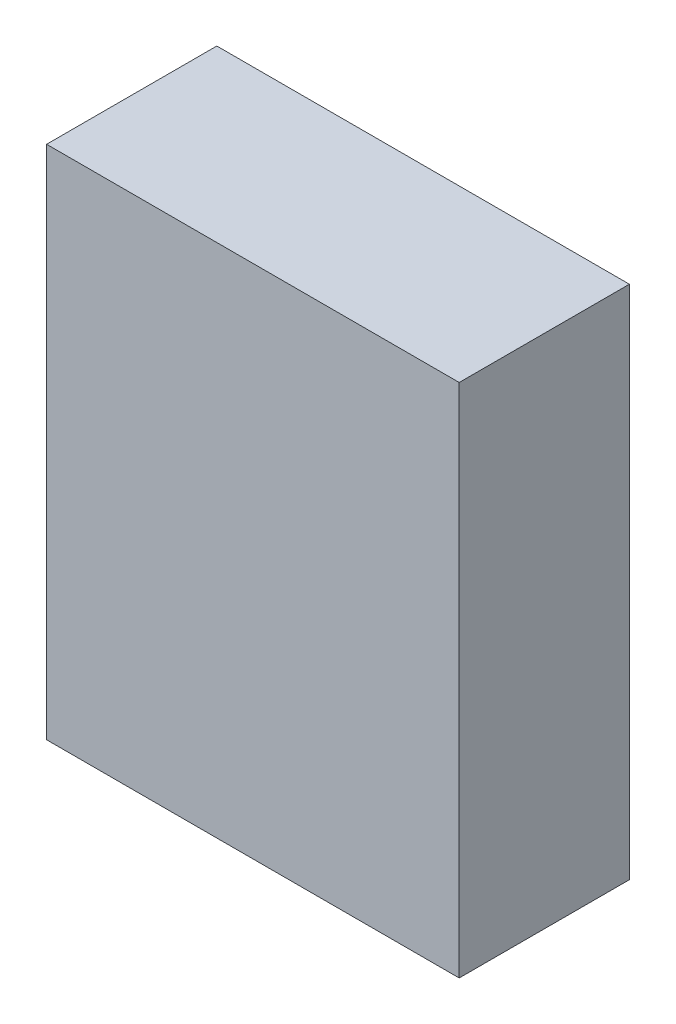
ISO-10303-21;
HEADER;
FILE_DESCRIPTION(('STEP AP214'),'2;1');
FILE_NAME('part.step','',(''),(''),'','','');
FILE_SCHEMA(('AUTOMOTIVE_DESIGN { 1 0 10303 214 1 1 1 1 }'));
ENDSEC;
DATA;
#1=APPLICATION_CONTEXT('core data for automotive mechanical design processes');
#2=APPLICATION_PROTOCOL_DEFINITION('international standard','automotive_design',2000,#1);
#3=PRODUCT_CONTEXT('',#1,'mechanical');
#4=PRODUCT('Part','Part','',(#3));
#5=PRODUCT_RELATED_PRODUCT_CATEGORY('part','',(#4));
#6=PRODUCT_DEFINITION_FORMATION('','',#4);
#7=PRODUCT_DEFINITION_CONTEXT('part definition',#1,'design');
#8=PRODUCT_DEFINITION('design','',#6,#7);
#9=PRODUCT_DEFINITION_SHAPE('','',#8);
#10=(LENGTH_UNIT() NAMED_UNIT(*) SI_UNIT(.MILLI.,.METRE.));
#11=(NAMED_UNIT(*) PLANE_ANGLE_UNIT() SI_UNIT($,.RADIAN.));
#12=(NAMED_UNIT(*) SI_UNIT($,.STERADIAN.) SOLID_ANGLE_UNIT());
#13=UNCERTAINTY_MEASURE_WITH_UNIT(LENGTH_MEASURE(1.E-05),#10,'distance_accuracy_value','');
#14=(GEOMETRIC_REPRESENTATION_CONTEXT(3) GLOBAL_UNCERTAINTY_ASSIGNED_CONTEXT((#13)) GLOBAL_UNIT_ASSIGNED_CONTEXT((#10,
#11,#12)) REPRESENTATION_CONTEXT('',''));
#15=CARTESIAN_POINT('',(0.,0.,0.));
#16=DIRECTION('',(0.,0.,1.));
#17=DIRECTION('',(1.,0.,0.));
#18=AXIS2_PLACEMENT_3D('',#15,#16,#17);
#19=CARTESIAN_POINT('',(-2.00000108,2.50000008,1.64999924));
#20=DIRECTION('',(0.,0.,-1.));
#21=DIRECTION('',(-1.,0.,0.));
#22=AXIS2_PLACEMENT_3D('',#19,#20,#21);
#23=PLANE('',#22);
#24=DIRECTION('',(1.,0.,0.));
#25=VECTOR('',#24,1.);
#26=CARTESIAN_POINT('',(-2.00000108,-2.50000008,1.64999924));
#27=LINE('',#26,#25);
#28=CARTESIAN_POINT('',(-2.00000108,-2.50000008,1.64999924));
#29=VERTEX_POINT('',#28);
#30=CARTESIAN_POINT('',(1.99999854,-2.50000008,1.64999924));
#31=VERTEX_POINT('',#30);
#32=EDGE_CURVE('E55',#29,#31,#27,.T.);
#33=ORIENTED_EDGE('',*,*,#32,.T.);
#34=DIRECTION('',(0.,1.,0.));
#35=VECTOR('',#34,1.);
#36=CARTESIAN_POINT('',(1.99999854,-2.50000008,1.64999924));
#37=LINE('',#36,#35);
#38=CARTESIAN_POINT('',(1.99999854,2.50000008,1.64999924));
#39=VERTEX_POINT('',#38);
#40=EDGE_CURVE('E57',#31,#39,#37,.T.);
#41=ORIENTED_EDGE('',*,*,#40,.T.);
#42=DIRECTION('',(1.,0.,0.));
#43=VECTOR('',#42,1.);
#44=CARTESIAN_POINT('',(1.99999854,2.50000008,1.64999924));
#45=LINE('',#44,#43);
#46=CARTESIAN_POINT('',(-2.00000108,2.50000008,1.64999924));
#47=VERTEX_POINT('',#46);
#48=EDGE_CURVE('E20',#39,#47,#45,.F.);
#49=ORIENTED_EDGE('',*,*,#48,.T.);
#50=DIRECTION('',(0.,1.,0.));
#51=VECTOR('',#50,1.);
#52=CARTESIAN_POINT('',(-2.00000108,2.50000008,1.64999924));
#53=LINE('',#52,#51);
#54=EDGE_CURVE('E80',#47,#29,#53,.F.);
#55=ORIENTED_EDGE('',*,*,#54,.T.);
#56=EDGE_LOOP('',(#33,#41,#49,#55));
#57=FACE_BOUND('',#56,.T.);
#58=ADVANCED_FACE('F17',(#57),#23,.F.);
#59=CARTESIAN_POINT('',(1.99999854,2.50000008,0.));
#60=DIRECTION('',(0.,-1.,0.));
#61=DIRECTION('',(0.,0.,-1.));
#62=AXIS2_PLACEMENT_3D('',#59,#60,#61);
#63=PLANE('',#62);
#64=DIRECTION('',(0.,0.,-1.));
#65=VECTOR('',#64,1.);
#66=CARTESIAN_POINT('',(-2.00000108,2.50000008,0.));
#67=LINE('',#66,#65);
#68=CARTESIAN_POINT('',(-2.00000108,2.50000008,0.));
#69=VERTEX_POINT('',#68);
#70=EDGE_CURVE('E68',#69,#47,#67,.F.);
#71=ORIENTED_EDGE('',*,*,#70,.T.);
#72=ORIENTED_EDGE('',*,*,#48,.F.);
#73=DIRECTION('',(0.,0.,1.));
#74=VECTOR('',#73,1.);
#75=CARTESIAN_POINT('',(1.99999854,2.50000008,0.));
#76=LINE('',#75,#74);
#77=CARTESIAN_POINT('',(1.99999854,2.50000008,0.));
#78=VERTEX_POINT('',#77);
#79=EDGE_CURVE('E63',#39,#78,#76,.F.);
#80=ORIENTED_EDGE('',*,*,#79,.T.);
#81=DIRECTION('',(-1.,0.,0.));
#82=VECTOR('',#81,1.);
#83=CARTESIAN_POINT('',(-2.00000108,2.50000008,0.));
#84=LINE('',#83,#82);
#85=EDGE_CURVE('E83',#69,#78,#84,.F.);
#86=ORIENTED_EDGE('',*,*,#85,.F.);
#87=EDGE_LOOP('',(#71,#72,#80,#86));
#88=FACE_BOUND('',#87,.T.);
#89=ADVANCED_FACE('F65',(#88),#63,.F.);
#90=CARTESIAN_POINT('',(1.99999854,-2.50000008,0.));
#91=DIRECTION('',(-1.,0.,0.));
#92=DIRECTION('',(0.,0.,1.));
#93=AXIS2_PLACEMENT_3D('',#90,#91,#92);
#94=PLANE('',#93);
#95=ORIENTED_EDGE('',*,*,#79,.F.);
#96=ORIENTED_EDGE('',*,*,#40,.F.);
#97=DIRECTION('',(0.,0.,1.));
#98=VECTOR('',#97,1.);
#99=CARTESIAN_POINT('',(1.99999854,-2.50000008,0.));
#100=LINE('',#99,#98);
#101=CARTESIAN_POINT('',(1.99999854,-2.50000008,0.));
#102=VERTEX_POINT('',#101);
#103=EDGE_CURVE('E75',#31,#102,#100,.F.);
#104=ORIENTED_EDGE('',*,*,#103,.T.);
#105=DIRECTION('',(0.,1.,0.));
#106=VECTOR('',#105,1.);
#107=CARTESIAN_POINT('',(1.99999854,2.50000008,0.));
#108=LINE('',#107,#106);
#109=EDGE_CURVE('E72',#78,#102,#108,.F.);
#110=ORIENTED_EDGE('',*,*,#109,.F.);
#111=EDGE_LOOP('',(#95,#96,#104,#110));
#112=FACE_BOUND('',#111,.T.);
#113=ADVANCED_FACE('F70',(#112),#94,.F.);
#114=CARTESIAN_POINT('',(-2.00000108,-2.50000008,0.));
#115=DIRECTION('',(0.,1.,0.));
#116=DIRECTION('',(0.,0.,1.));
#117=AXIS2_PLACEMENT_3D('',#114,#115,#116);
#118=PLANE('',#117);
#119=ORIENTED_EDGE('',*,*,#103,.F.);
#120=ORIENTED_EDGE('',*,*,#32,.F.);
#121=DIRECTION('',(0.,0.,-1.));
#122=VECTOR('',#121,1.);
#123=CARTESIAN_POINT('',(-2.00000108,-2.50000008,0.));
#124=LINE('',#123,#122);
#125=CARTESIAN_POINT('',(-2.00000108,-2.50000008,0.));
#126=VERTEX_POINT('',#125);
#127=EDGE_CURVE('E35',#29,#126,#124,.T.);
#128=ORIENTED_EDGE('',*,*,#127,.T.);
#129=DIRECTION('',(-1.,0.,0.));
#130=VECTOR('',#129,1.);
#131=CARTESIAN_POINT('',(-2.00000108,-2.50000008,0.));
#132=LINE('',#131,#130);
#133=EDGE_CURVE('E26',#102,#126,#132,.T.);
#134=ORIENTED_EDGE('',*,*,#133,.F.);
#135=EDGE_LOOP('',(#119,#120,#128,#134));
#136=FACE_BOUND('',#135,.T.);
#137=ADVANCED_FACE('F89',(#136),#118,.F.);
#138=CARTESIAN_POINT('',(-2.00000108,2.50000008,0.));
#139=DIRECTION('',(1.,0.,0.));
#140=DIRECTION('',(0.,0.,-1.));
#141=AXIS2_PLACEMENT_3D('',#138,#139,#140);
#142=PLANE('',#141);
#143=ORIENTED_EDGE('',*,*,#127,.F.);
#144=ORIENTED_EDGE('',*,*,#54,.F.);
#145=ORIENTED_EDGE('',*,*,#70,.F.);
#146=DIRECTION('',(0.,1.,0.));
#147=VECTOR('',#146,1.);
#148=CARTESIAN_POINT('',(-2.00000108,2.50000008,0.));
#149=LINE('',#148,#147);
#150=EDGE_CURVE('E11',#126,#69,#149,.T.);
#151=ORIENTED_EDGE('',*,*,#150,.F.);
#152=EDGE_LOOP('',(#143,#144,#145,#151));
#153=FACE_BOUND('',#152,.T.);
#154=ADVANCED_FACE('F91',(#153),#142,.F.);
#155=CARTESIAN_POINT('',(-2.00000108,2.50000008,0.));
#156=DIRECTION('',(0.,0.,-1.));
#157=DIRECTION('',(-1.,0.,0.));
#158=AXIS2_PLACEMENT_3D('',#155,#156,#157);
#159=PLANE('',#158);
#160=ORIENTED_EDGE('',*,*,#133,.T.);
#161=ORIENTED_EDGE('',*,*,#150,.T.);
#162=ORIENTED_EDGE('',*,*,#85,.T.);
#163=ORIENTED_EDGE('',*,*,#109,.T.);
#164=EDGE_LOOP('',(#160,#161,#162,#163));
#165=FACE_BOUND('',#164,.T.);
#166=ADVANCED_FACE('F88',(#165),#159,.T.);
#167=CLOSED_SHELL('',(#58,#89,#113,#137,#154,#166));
#168=MANIFOLD_SOLID_BREP('B1',#167);
#169=ADVANCED_BREP_SHAPE_REPRESENTATION('',(#18,#168),#14);
#170=SHAPE_DEFINITION_REPRESENTATION(#9,#169);
ENDSEC;
END-ISO-10303-21;
